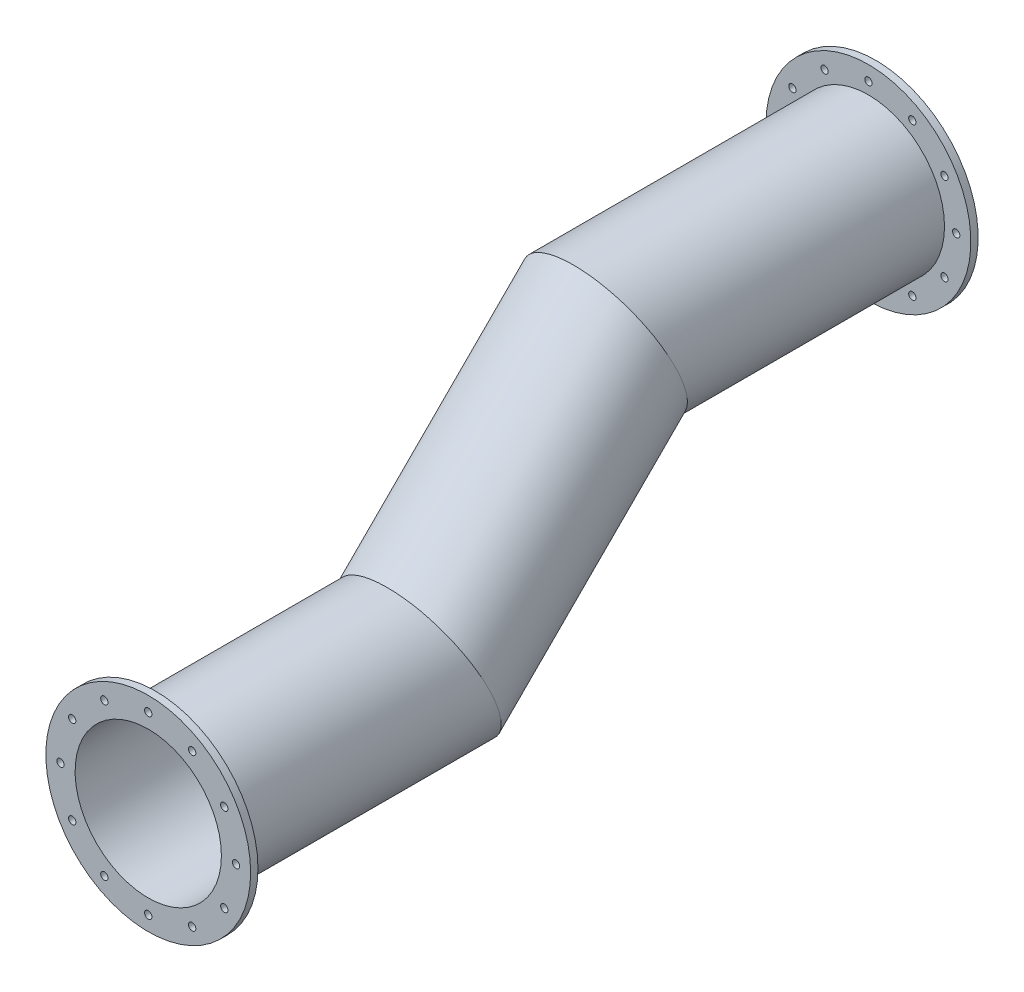
ISO-10303-21;
HEADER;
FILE_DESCRIPTION(('STEP AP214'),'2;1');
FILE_NAME('part.step','',(''),(''),'','','');
FILE_SCHEMA(('AUTOMOTIVE_DESIGN { 1 0 10303 214 1 1 1 1 }'));
ENDSEC;
DATA;
#1=APPLICATION_CONTEXT('core data for automotive mechanical design processes');
#2=APPLICATION_PROTOCOL_DEFINITION('international standard','automotive_design',2000,#1);
#3=PRODUCT_CONTEXT('',#1,'mechanical');
#4=PRODUCT('Part','Part','',(#3));
#5=PRODUCT_RELATED_PRODUCT_CATEGORY('part','',(#4));
#6=PRODUCT_DEFINITION_FORMATION('','',#4);
#7=PRODUCT_DEFINITION_CONTEXT('part definition',#1,'design');
#8=PRODUCT_DEFINITION('design','',#6,#7);
#9=PRODUCT_DEFINITION_SHAPE('','',#8);
#10=(LENGTH_UNIT() NAMED_UNIT(*) SI_UNIT(.MILLI.,.METRE.));
#11=(NAMED_UNIT(*) PLANE_ANGLE_UNIT() SI_UNIT($,.RADIAN.));
#12=(NAMED_UNIT(*) SI_UNIT($,.STERADIAN.) SOLID_ANGLE_UNIT());
#13=UNCERTAINTY_MEASURE_WITH_UNIT(LENGTH_MEASURE(1.E-05),#10,'distance_accuracy_value','');
#14=(GEOMETRIC_REPRESENTATION_CONTEXT(3) GLOBAL_UNCERTAINTY_ASSIGNED_CONTEXT((#13)) GLOBAL_UNIT_ASSIGNED_CONTEXT((#10,
#11,#12)) REPRESENTATION_CONTEXT('',''));
#15=CARTESIAN_POINT('',(0.,0.,0.));
#16=DIRECTION('',(0.,0.,1.));
#17=DIRECTION('',(1.,0.,0.));
#18=AXIS2_PLACEMENT_3D('',#15,#16,#17);
#19=CARTESIAN_POINT('',(0.,127.279220613579,-261.615728752538));
#20=DIRECTION('',(0.,0.,-1.));
#21=DIRECTION('',(-1.,0.,0.));
#22=AXIS2_PLACEMENT_3D('',#19,#20,#21);
#23=CYLINDRICAL_SURFACE('',#22,52.);
#24=CARTESIAN_POINT('',(0.,127.279220613579,-307.279220613579));
#25=DIRECTION('',(0.,0.38268343236509,-0.923879532511287));
#26=DIRECTION('',(0.,0.923879532511287,0.38268343236509));
#27=AXIS2_PLACEMENT_3D('',#24,#25,#26);
#28=ELLIPSE('',#27,56.2843944152045,52.);
#29=CARTESIAN_POINT('',(0.,179.279220613579,-285.740115370178));
#30=VERTEX_POINT('',#29);
#31=EDGE_CURVE('E48',#30,#30,#28,.T.);
#32=ORIENTED_EDGE('',*,*,#31,.T.);
#33=EDGE_LOOP('',(#32));
#34=FACE_BOUND('',#33,.T.);
#35=CARTESIAN_POINT('',(0.,127.279220613579,-487.279220613578));
#36=DIRECTION('',(0.,0.,1.));
#37=DIRECTION('',(1.,0.,0.));
#38=AXIS2_PLACEMENT_3D('',#35,#36,#37);
#39=CIRCLE('',#38,52.);
#40=CARTESIAN_POINT('',(52.,127.279220613579,-487.279220613578));
#41=VERTEX_POINT('',#40);
#42=EDGE_CURVE('E51',#41,#41,#39,.T.);
#43=ORIENTED_EDGE('',*,*,#42,.T.);
#44=EDGE_LOOP('',(#43));
#45=FACE_BOUND('',#44,.T.);
#46=ADVANCED_FACE('F36',(#34,#45),#23,.T.);
#47=CARTESIAN_POINT('',(0.,-32.2889647475984,-147.711035252402));
#48=DIRECTION('',(0.,0.707106781186548,-0.707106781186547));
#49=DIRECTION('',(0.,0.707106781186547,0.707106781186548));
#50=AXIS2_PLACEMENT_3D('',#47,#48,#49);
#51=CYLINDRICAL_SURFACE('',#50,52.);
#52=CARTESIAN_POINT('',(0.,0.,-180.));
#53=DIRECTION('',(0.,0.38268343236509,-0.923879532511287));
#54=DIRECTION('',(0.,-0.923879532511287,-0.38268343236509));
#55=AXIS2_PLACEMENT_3D('',#52,#53,#54);
#56=ELLIPSE('',#55,56.2843944152045,52.);
#57=CARTESIAN_POINT('',(0.,-52.,-201.539105243401));
#58=VERTEX_POINT('',#57);
#59=EDGE_CURVE('E10',#58,#58,#56,.T.);
#60=ORIENTED_EDGE('',*,*,#59,.T.);
#61=EDGE_LOOP('',(#60));
#62=FACE_BOUND('',#61,.T.);
#63=ORIENTED_EDGE('',*,*,#31,.F.);
#64=EDGE_LOOP('',(#63));
#65=FACE_BOUND('',#64,.T.);
#66=ADVANCED_FACE('F262',(#62,#65),#51,.T.);
#67=CARTESIAN_POINT('',(0.,0.,0.));
#68=DIRECTION('',(0.,0.,-1.));
#69=DIRECTION('',(-1.,0.,0.));
#70=AXIS2_PLACEMENT_3D('',#67,#68,#69);
#71=CYLINDRICAL_SURFACE('',#70,52.);
#72=CARTESIAN_POINT('',(0.,0.,0.));
#73=DIRECTION('',(0.,0.,1.));
#74=DIRECTION('',(1.,0.,0.));
#75=AXIS2_PLACEMENT_3D('',#72,#73,#74);
#76=CIRCLE('',#75,52.);
#77=CARTESIAN_POINT('',(52.,0.,0.));
#78=VERTEX_POINT('',#77);
#79=EDGE_CURVE('E40',#78,#78,#76,.T.);
#80=ORIENTED_EDGE('',*,*,#79,.F.);
#81=EDGE_LOOP('',(#80));
#82=FACE_BOUND('',#81,.T.);
#83=ORIENTED_EDGE('',*,*,#59,.F.);
#84=EDGE_LOOP('',(#83));
#85=FACE_BOUND('',#84,.T.);
#86=ADVANCED_FACE('F38',(#82,#85),#71,.T.);
#87=CARTESIAN_POINT('',(0.,127.279220613579,-261.615728752538));
#88=DIRECTION('',(0.,0.,-1.));
#89=DIRECTION('',(-1.,0.,0.));
#90=AXIS2_PLACEMENT_3D('',#87,#88,#89);
#91=CYLINDRICAL_SURFACE('',#90,50.);
#92=CARTESIAN_POINT('',(0.,127.279220613579,-307.279220613579));
#93=DIRECTION('',(0.,0.38268343236509,-0.923879532511287));
#94=DIRECTION('',(0.,0.923879532511287,0.38268343236509));
#95=AXIS2_PLACEMENT_3D('',#92,#93,#94);
#96=ELLIPSE('',#95,54.1196100146197,50.);
#97=CARTESIAN_POINT('',(0.,177.279220613579,-286.568542494924));
#98=VERTEX_POINT('',#97);
#99=EDGE_CURVE('E146',#98,#98,#96,.T.);
#100=ORIENTED_EDGE('',*,*,#99,.F.);
#101=EDGE_LOOP('',(#100));
#102=FACE_BOUND('',#101,.T.);
#103=CARTESIAN_POINT('',(0.,127.279220613579,-492.279220613578));
#104=DIRECTION('',(0.,0.,-1.));
#105=DIRECTION('',(-1.,0.,0.));
#106=AXIS2_PLACEMENT_3D('',#103,#104,#105);
#107=CIRCLE('',#106,50.);
#108=CARTESIAN_POINT('',(-50.,127.279220613579,-492.279220613578));
#109=VERTEX_POINT('',#108);
#110=EDGE_CURVE('E66',#109,#109,#107,.T.);
#111=ORIENTED_EDGE('',*,*,#110,.T.);
#112=EDGE_LOOP('',(#111));
#113=FACE_BOUND('',#112,.T.);
#114=ADVANCED_FACE('F156',(#102,#113),#91,.F.);
#115=CARTESIAN_POINT('',(0.,-32.2889647475984,-147.711035252402));
#116=DIRECTION('',(0.,0.707106781186548,-0.707106781186547));
#117=DIRECTION('',(0.,0.707106781186547,0.707106781186548));
#118=AXIS2_PLACEMENT_3D('',#115,#116,#117);
#119=CYLINDRICAL_SURFACE('',#118,50.);
#120=CARTESIAN_POINT('',(0.,0.,-180.));
#121=DIRECTION('',(0.,0.38268343236509,-0.923879532511287));
#122=DIRECTION('',(0.,-0.923879532511287,-0.38268343236509));
#123=AXIS2_PLACEMENT_3D('',#120,#121,#122);
#124=ELLIPSE('',#123,54.1196100146197,50.);
#125=CARTESIAN_POINT('',(0.,-50.,-200.710678118655));
#126=VERTEX_POINT('',#125);
#127=EDGE_CURVE('E149',#126,#126,#124,.T.);
#128=ORIENTED_EDGE('',*,*,#127,.F.);
#129=EDGE_LOOP('',(#128));
#130=FACE_BOUND('',#129,.T.);
#131=ORIENTED_EDGE('',*,*,#99,.T.);
#132=EDGE_LOOP('',(#131));
#133=FACE_BOUND('',#132,.T.);
#134=ADVANCED_FACE('F154',(#130,#133),#119,.F.);
#135=CARTESIAN_POINT('',(0.,0.,0.));
#136=DIRECTION('',(0.,0.,-1.));
#137=DIRECTION('',(-1.,0.,0.));
#138=AXIS2_PLACEMENT_3D('',#135,#136,#137);
#139=CYLINDRICAL_SURFACE('',#138,50.);
#140=ORIENTED_EDGE('',*,*,#127,.T.);
#141=EDGE_LOOP('',(#140));
#142=FACE_BOUND('',#141,.T.);
#143=CARTESIAN_POINT('',(0.,0.,5.));
#144=DIRECTION('',(0.,0.,1.));
#145=DIRECTION('',(1.,0.,0.));
#146=AXIS2_PLACEMENT_3D('',#143,#144,#145);
#147=CIRCLE('',#146,50.);
#148=CARTESIAN_POINT('',(50.,0.,5.));
#149=VERTEX_POINT('',#148);
#150=EDGE_CURVE('E137',#149,#149,#147,.T.);
#151=ORIENTED_EDGE('',*,*,#150,.T.);
#152=EDGE_LOOP('',(#151));
#153=FACE_BOUND('',#152,.T.);
#154=ADVANCED_FACE('F350',(#142,#153),#139,.F.);
#155=CARTESIAN_POINT('',(0.,0.,5.));
#156=DIRECTION('',(0.,0.,1.));
#157=DIRECTION('',(1.,0.,0.));
#158=AXIS2_PLACEMENT_3D('',#155,#156,#157);
#159=PLANE('',#158);
#160=CARTESIAN_POINT('',(51.9615242270663,-30.,5.));
#161=DIRECTION('',(0.,0.,1.));
#162=DIRECTION('',(1.,0.,0.));
#163=AXIS2_PLACEMENT_3D('',#160,#161,#162);
#164=CIRCLE('',#163,2.5);
#165=CARTESIAN_POINT('',(54.4615242270663,-30.,5.));
#166=VERTEX_POINT('',#165);
#167=EDGE_CURVE('E74',#166,#166,#164,.T.);
#168=ORIENTED_EDGE('',*,*,#167,.F.);
#169=EDGE_LOOP('',(#168));
#170=FACE_BOUND('',#169,.T.);
#171=CARTESIAN_POINT('',(51.9615242270663,30.,5.));
#172=DIRECTION('',(0.,0.,1.));
#173=DIRECTION('',(1.,0.,0.));
#174=AXIS2_PLACEMENT_3D('',#171,#172,#173);
#175=CIRCLE('',#174,2.50000000000001);
#176=CARTESIAN_POINT('',(54.4615242270663,30.,5.));
#177=VERTEX_POINT('',#176);
#178=EDGE_CURVE('E86',#177,#177,#175,.T.);
#179=ORIENTED_EDGE('',*,*,#178,.F.);
#180=EDGE_LOOP('',(#179));
#181=FACE_BOUND('',#180,.T.);
#182=CARTESIAN_POINT('',(0.,60.,5.));
#183=DIRECTION('',(0.,0.,1.));
#184=DIRECTION('',(1.,0.,0.));
#185=AXIS2_PLACEMENT_3D('',#182,#183,#184);
#186=CIRCLE('',#185,2.5);
#187=CARTESIAN_POINT('',(2.5,60.,5.));
#188=VERTEX_POINT('',#187);
#189=EDGE_CURVE('E98',#188,#188,#186,.T.);
#190=ORIENTED_EDGE('',*,*,#189,.F.);
#191=EDGE_LOOP('',(#190));
#192=FACE_BOUND('',#191,.T.);
#193=CARTESIAN_POINT('',(-51.9615242270663,30.,5.));
#194=DIRECTION('',(0.,0.,1.));
#195=DIRECTION('',(1.,0.,0.));
#196=AXIS2_PLACEMENT_3D('',#193,#194,#195);
#197=CIRCLE('',#196,2.5);
#198=CARTESIAN_POINT('',(-49.4615242270663,30.,5.));
#199=VERTEX_POINT('',#198);
#200=EDGE_CURVE('E110',#199,#199,#197,.T.);
#201=ORIENTED_EDGE('',*,*,#200,.F.);
#202=EDGE_LOOP('',(#201));
#203=FACE_BOUND('',#202,.T.);
#204=CARTESIAN_POINT('',(-51.9615242270663,-30.,5.));
#205=DIRECTION('',(0.,0.,1.));
#206=DIRECTION('',(1.,0.,0.));
#207=AXIS2_PLACEMENT_3D('',#204,#205,#206);
#208=CIRCLE('',#207,2.50000000000001);
#209=CARTESIAN_POINT('',(-49.4615242270663,-30.,5.));
#210=VERTEX_POINT('',#209);
#211=EDGE_CURVE('E122',#210,#210,#208,.T.);
#212=ORIENTED_EDGE('',*,*,#211,.F.);
#213=EDGE_LOOP('',(#212));
#214=FACE_BOUND('',#213,.T.);
#215=CARTESIAN_POINT('',(0.,-60.,5.));
#216=DIRECTION('',(0.,0.,1.));
#217=DIRECTION('',(1.,0.,0.));
#218=AXIS2_PLACEMENT_3D('',#215,#216,#217);
#219=CIRCLE('',#218,2.5);
#220=CARTESIAN_POINT('',(2.5,-60.,5.));
#221=VERTEX_POINT('',#220);
#222=EDGE_CURVE('E134',#221,#221,#219,.T.);
#223=ORIENTED_EDGE('',*,*,#222,.F.);
#224=EDGE_LOOP('',(#223));
#225=FACE_BOUND('',#224,.T.);
#226=CARTESIAN_POINT('',(0.,0.,5.));
#227=DIRECTION('',(0.,0.,1.));
#228=DIRECTION('',(1.,0.,0.));
#229=AXIS2_PLACEMENT_3D('',#226,#227,#228);
#230=CIRCLE('',#229,70.0000000000001);
#231=CARTESIAN_POINT('',(70.0000000000001,0.,5.));
#232=VERTEX_POINT('',#231);
#233=EDGE_CURVE('E143',#232,#232,#230,.T.);
#234=ORIENTED_EDGE('',*,*,#233,.T.);
#235=EDGE_LOOP('',(#234));
#236=FACE_BOUND('',#235,.T.);
#237=ORIENTED_EDGE('',*,*,#150,.F.);
#238=EDGE_LOOP('',(#237));
#239=FACE_BOUND('',#238,.T.);
#240=CARTESIAN_POINT('',(-30.,-51.9615242270663,5.));
#241=DIRECTION('',(0.,0.,1.));
#242=DIRECTION('',(1.,0.,0.));
#243=AXIS2_PLACEMENT_3D('',#240,#241,#242);
#244=CIRCLE('',#243,2.5);
#245=CARTESIAN_POINT('',(-27.5,-51.9615242270663,5.));
#246=VERTEX_POINT('',#245);
#247=EDGE_CURVE('E128',#246,#246,#244,.T.);
#248=ORIENTED_EDGE('',*,*,#247,.F.);
#249=EDGE_LOOP('',(#248));
#250=FACE_BOUND('',#249,.T.);
#251=CARTESIAN_POINT('',(-60.,0.,5.));
#252=DIRECTION('',(0.,0.,1.));
#253=DIRECTION('',(1.,0.,0.));
#254=AXIS2_PLACEMENT_3D('',#251,#252,#253);
#255=CIRCLE('',#254,2.5);
#256=CARTESIAN_POINT('',(-57.5,0.,5.));
#257=VERTEX_POINT('',#256);
#258=EDGE_CURVE('E116',#257,#257,#255,.T.);
#259=ORIENTED_EDGE('',*,*,#258,.F.);
#260=EDGE_LOOP('',(#259));
#261=FACE_BOUND('',#260,.T.);
#262=CARTESIAN_POINT('',(-30.,51.9615242270663,5.));
#263=DIRECTION('',(0.,0.,1.));
#264=DIRECTION('',(1.,0.,0.));
#265=AXIS2_PLACEMENT_3D('',#262,#263,#264);
#266=CIRCLE('',#265,2.5);
#267=CARTESIAN_POINT('',(-27.5,51.9615242270663,5.));
#268=VERTEX_POINT('',#267);
#269=EDGE_CURVE('E104',#268,#268,#266,.T.);
#270=ORIENTED_EDGE('',*,*,#269,.F.);
#271=EDGE_LOOP('',(#270));
#272=FACE_BOUND('',#271,.T.);
#273=CARTESIAN_POINT('',(30.,51.9615242270663,5.));
#274=DIRECTION('',(0.,0.,1.));
#275=DIRECTION('',(1.,0.,0.));
#276=AXIS2_PLACEMENT_3D('',#273,#274,#275);
#277=CIRCLE('',#276,2.50000000000001);
#278=CARTESIAN_POINT('',(32.5,51.9615242270663,5.));
#279=VERTEX_POINT('',#278);
#280=EDGE_CURVE('E92',#279,#279,#277,.T.);
#281=ORIENTED_EDGE('',*,*,#280,.F.);
#282=EDGE_LOOP('',(#281));
#283=FACE_BOUND('',#282,.T.);
#284=CARTESIAN_POINT('',(60.,0.,5.));
#285=DIRECTION('',(0.,0.,1.));
#286=DIRECTION('',(1.,0.,0.));
#287=AXIS2_PLACEMENT_3D('',#284,#285,#286);
#288=CIRCLE('',#287,2.5);
#289=CARTESIAN_POINT('',(62.5,0.,5.));
#290=VERTEX_POINT('',#289);
#291=EDGE_CURVE('E80',#290,#290,#288,.T.);
#292=ORIENTED_EDGE('',*,*,#291,.F.);
#293=EDGE_LOOP('',(#292));
#294=FACE_BOUND('',#293,.T.);
#295=CARTESIAN_POINT('',(30.,-51.9615242270663,5.));
#296=DIRECTION('',(0.,0.,1.));
#297=DIRECTION('',(1.,0.,0.));
#298=AXIS2_PLACEMENT_3D('',#295,#296,#297);
#299=CIRCLE('',#298,2.5);
#300=CARTESIAN_POINT('',(32.5,-51.9615242270663,5.));
#301=VERTEX_POINT('',#300);
#302=EDGE_CURVE('E58',#301,#301,#299,.T.);
#303=ORIENTED_EDGE('',*,*,#302,.F.);
#304=EDGE_LOOP('',(#303));
#305=FACE_BOUND('',#304,.T.);
#306=ADVANCED_FACE('F160',(#170,#181,#192,#203,#214,#225,#236,#239,#250,#261,#272,#283,#294,
#305),#159,.T.);
#307=CARTESIAN_POINT('',(0.,0.,0.));
#308=DIRECTION('',(0.,0.,1.));
#309=DIRECTION('',(1.,0.,0.));
#310=AXIS2_PLACEMENT_3D('',#307,#308,#309);
#311=PLANE('',#310);
#312=ORIENTED_EDGE('',*,*,#79,.T.);
#313=EDGE_LOOP('',(#312));
#314=FACE_BOUND('',#313,.T.);
#315=CARTESIAN_POINT('',(0.,0.,0.));
#316=DIRECTION('',(0.,0.,1.));
#317=DIRECTION('',(1.,0.,0.));
#318=AXIS2_PLACEMENT_3D('',#315,#316,#317);
#319=CIRCLE('',#318,70.0000000000001);
#320=CARTESIAN_POINT('',(70.0000000000001,0.,0.));
#321=VERTEX_POINT('',#320);
#322=EDGE_CURVE('E142',#321,#321,#319,.T.);
#323=ORIENTED_EDGE('',*,*,#322,.F.);
#324=EDGE_LOOP('',(#323));
#325=FACE_BOUND('',#324,.T.);
#326=CARTESIAN_POINT('',(0.,-60.,0.));
#327=DIRECTION('',(0.,0.,1.));
#328=DIRECTION('',(1.,0.,0.));
#329=AXIS2_PLACEMENT_3D('',#326,#327,#328);
#330=CIRCLE('',#329,2.5);
#331=CARTESIAN_POINT('',(2.5,-60.,0.));
#332=VERTEX_POINT('',#331);
#333=EDGE_CURVE('E131',#332,#332,#330,.T.);
#334=ORIENTED_EDGE('',*,*,#333,.T.);
#335=EDGE_LOOP('',(#334));
#336=FACE_BOUND('',#335,.T.);
#337=CARTESIAN_POINT('',(-30.,-51.9615242270663,0.));
#338=DIRECTION('',(0.,0.,1.));
#339=DIRECTION('',(1.,0.,0.));
#340=AXIS2_PLACEMENT_3D('',#337,#338,#339);
#341=CIRCLE('',#340,2.5);
#342=CARTESIAN_POINT('',(-27.5,-51.9615242270663,0.));
#343=VERTEX_POINT('',#342);
#344=EDGE_CURVE('E125',#343,#343,#341,.T.);
#345=ORIENTED_EDGE('',*,*,#344,.T.);
#346=EDGE_LOOP('',(#345));
#347=FACE_BOUND('',#346,.T.);
#348=CARTESIAN_POINT('',(-51.9615242270663,-30.,0.));
#349=DIRECTION('',(0.,0.,1.));
#350=DIRECTION('',(1.,0.,0.));
#351=AXIS2_PLACEMENT_3D('',#348,#349,#350);
#352=CIRCLE('',#351,2.50000000000001);
#353=CARTESIAN_POINT('',(-49.4615242270663,-30.,0.));
#354=VERTEX_POINT('',#353);
#355=EDGE_CURVE('E119',#354,#354,#352,.T.);
#356=ORIENTED_EDGE('',*,*,#355,.T.);
#357=EDGE_LOOP('',(#356));
#358=FACE_BOUND('',#357,.T.);
#359=CARTESIAN_POINT('',(-60.,0.,0.));
#360=DIRECTION('',(0.,0.,1.));
#361=DIRECTION('',(1.,0.,0.));
#362=AXIS2_PLACEMENT_3D('',#359,#360,#361);
#363=CIRCLE('',#362,2.5);
#364=CARTESIAN_POINT('',(-57.5,0.,0.));
#365=VERTEX_POINT('',#364);
#366=EDGE_CURVE('E113',#365,#365,#363,.T.);
#367=ORIENTED_EDGE('',*,*,#366,.T.);
#368=EDGE_LOOP('',(#367));
#369=FACE_BOUND('',#368,.T.);
#370=CARTESIAN_POINT('',(-51.9615242270663,30.,0.));
#371=DIRECTION('',(0.,0.,1.));
#372=DIRECTION('',(1.,0.,0.));
#373=AXIS2_PLACEMENT_3D('',#370,#371,#372);
#374=CIRCLE('',#373,2.5);
#375=CARTESIAN_POINT('',(-49.4615242270663,30.,0.));
#376=VERTEX_POINT('',#375);
#377=EDGE_CURVE('E107',#376,#376,#374,.T.);
#378=ORIENTED_EDGE('',*,*,#377,.T.);
#379=EDGE_LOOP('',(#378));
#380=FACE_BOUND('',#379,.T.);
#381=CARTESIAN_POINT('',(-30.,51.9615242270663,0.));
#382=DIRECTION('',(0.,0.,1.));
#383=DIRECTION('',(1.,0.,0.));
#384=AXIS2_PLACEMENT_3D('',#381,#382,#383);
#385=CIRCLE('',#384,2.5);
#386=CARTESIAN_POINT('',(-27.5,51.9615242270663,0.));
#387=VERTEX_POINT('',#386);
#388=EDGE_CURVE('E101',#387,#387,#385,.T.);
#389=ORIENTED_EDGE('',*,*,#388,.T.);
#390=EDGE_LOOP('',(#389));
#391=FACE_BOUND('',#390,.T.);
#392=CARTESIAN_POINT('',(0.,60.,0.));
#393=DIRECTION('',(0.,0.,1.));
#394=DIRECTION('',(1.,0.,0.));
#395=AXIS2_PLACEMENT_3D('',#392,#393,#394);
#396=CIRCLE('',#395,2.5);
#397=CARTESIAN_POINT('',(2.5,60.,0.));
#398=VERTEX_POINT('',#397);
#399=EDGE_CURVE('E95',#398,#398,#396,.T.);
#400=ORIENTED_EDGE('',*,*,#399,.T.);
#401=EDGE_LOOP('',(#400));
#402=FACE_BOUND('',#401,.T.);
#403=CARTESIAN_POINT('',(30.,51.9615242270663,0.));
#404=DIRECTION('',(0.,0.,1.));
#405=DIRECTION('',(1.,0.,0.));
#406=AXIS2_PLACEMENT_3D('',#403,#404,#405);
#407=CIRCLE('',#406,2.50000000000001);
#408=CARTESIAN_POINT('',(32.5,51.9615242270663,0.));
#409=VERTEX_POINT('',#408);
#410=EDGE_CURVE('E89',#409,#409,#407,.T.);
#411=ORIENTED_EDGE('',*,*,#410,.T.);
#412=EDGE_LOOP('',(#411));
#413=FACE_BOUND('',#412,.T.);
#414=CARTESIAN_POINT('',(51.9615242270663,30.,0.));
#415=DIRECTION('',(0.,0.,1.));
#416=DIRECTION('',(1.,0.,0.));
#417=AXIS2_PLACEMENT_3D('',#414,#415,#416);
#418=CIRCLE('',#417,2.50000000000001);
#419=CARTESIAN_POINT('',(54.4615242270663,30.,0.));
#420=VERTEX_POINT('',#419);
#421=EDGE_CURVE('E83',#420,#420,#418,.T.);
#422=ORIENTED_EDGE('',*,*,#421,.T.);
#423=EDGE_LOOP('',(#422));
#424=FACE_BOUND('',#423,.T.);
#425=CARTESIAN_POINT('',(60.,0.,0.));
#426=DIRECTION('',(0.,0.,1.));
#427=DIRECTION('',(1.,0.,0.));
#428=AXIS2_PLACEMENT_3D('',#425,#426,#427);
#429=CIRCLE('',#428,2.5);
#430=CARTESIAN_POINT('',(62.5,0.,0.));
#431=VERTEX_POINT('',#430);
#432=EDGE_CURVE('E77',#431,#431,#429,.T.);
#433=ORIENTED_EDGE('',*,*,#432,.T.);
#434=EDGE_LOOP('',(#433));
#435=FACE_BOUND('',#434,.T.);
#436=CARTESIAN_POINT('',(51.9615242270663,-30.,0.));
#437=DIRECTION('',(0.,0.,1.));
#438=DIRECTION('',(1.,0.,0.));
#439=AXIS2_PLACEMENT_3D('',#436,#437,#438);
#440=CIRCLE('',#439,2.5);
#441=CARTESIAN_POINT('',(54.4615242270663,-30.,0.));
#442=VERTEX_POINT('',#441);
#443=EDGE_CURVE('E72',#442,#442,#440,.T.);
#444=ORIENTED_EDGE('',*,*,#443,.T.);
#445=EDGE_LOOP('',(#444));
#446=FACE_BOUND('',#445,.T.);
#447=CARTESIAN_POINT('',(30.,-51.9615242270663,0.));
#448=DIRECTION('',(0.,0.,1.));
#449=DIRECTION('',(1.,0.,0.));
#450=AXIS2_PLACEMENT_3D('',#447,#448,#449);
#451=CIRCLE('',#450,2.5);
#452=CARTESIAN_POINT('',(32.5,-51.9615242270663,0.));
#453=VERTEX_POINT('',#452);
#454=EDGE_CURVE('E53',#453,#453,#451,.T.);
#455=ORIENTED_EDGE('',*,*,#454,.T.);
#456=EDGE_LOOP('',(#455));
#457=FACE_BOUND('',#456,.T.);
#458=ADVANCED_FACE('F270',(#314,#325,#336,#347,#358,#369,#380,#391,#402,#413,#424,#435,#446,
#457),#311,.F.);
#459=CARTESIAN_POINT('',(0.,0.,5.));
#460=DIRECTION('',(0.,0.,-1.));
#461=DIRECTION('',(-1.,0.,0.));
#462=AXIS2_PLACEMENT_3D('',#459,#460,#461);
#463=CYLINDRICAL_SURFACE('',#462,70.0000000000001);
#464=ORIENTED_EDGE('',*,*,#233,.F.);
#465=EDGE_LOOP('',(#464));
#466=FACE_BOUND('',#465,.T.);
#467=ORIENTED_EDGE('',*,*,#322,.T.);
#468=EDGE_LOOP('',(#467));
#469=FACE_BOUND('',#468,.T.);
#470=ADVANCED_FACE('F273',(#466,#469),#463,.T.);
#471=CARTESIAN_POINT('',(0.,-60.,5.));
#472=DIRECTION('',(0.,0.,-1.));
#473=DIRECTION('',(-1.,0.,0.));
#474=AXIS2_PLACEMENT_3D('',#471,#472,#473);
#475=CYLINDRICAL_SURFACE('',#474,2.5);
#476=ORIENTED_EDGE('',*,*,#222,.T.);
#477=EDGE_LOOP('',(#476));
#478=FACE_BOUND('',#477,.T.);
#479=ORIENTED_EDGE('',*,*,#333,.F.);
#480=EDGE_LOOP('',(#479));
#481=FACE_BOUND('',#480,.T.);
#482=ADVANCED_FACE('F344',(#478,#481),#475,.F.);
#483=CARTESIAN_POINT('',(-30.,-51.9615242270663,5.));
#484=DIRECTION('',(0.,0.,-1.));
#485=DIRECTION('',(-1.,0.,0.));
#486=AXIS2_PLACEMENT_3D('',#483,#484,#485);
#487=CYLINDRICAL_SURFACE('',#486,2.5);
#488=ORIENTED_EDGE('',*,*,#247,.T.);
#489=EDGE_LOOP('',(#488));
#490=FACE_BOUND('',#489,.T.);
#491=ORIENTED_EDGE('',*,*,#344,.F.);
#492=EDGE_LOOP('',(#491));
#493=FACE_BOUND('',#492,.T.);
#494=ADVANCED_FACE('F340',(#490,#493),#487,.F.);
#495=CARTESIAN_POINT('',(-51.9615242270663,-30.,5.));
#496=DIRECTION('',(0.,0.,-1.));
#497=DIRECTION('',(-1.,0.,0.));
#498=AXIS2_PLACEMENT_3D('',#495,#496,#497);
#499=CYLINDRICAL_SURFACE('',#498,2.50000000000001);
#500=ORIENTED_EDGE('',*,*,#211,.T.);
#501=EDGE_LOOP('',(#500));
#502=FACE_BOUND('',#501,.T.);
#503=ORIENTED_EDGE('',*,*,#355,.F.);
#504=EDGE_LOOP('',(#503));
#505=FACE_BOUND('',#504,.T.);
#506=ADVANCED_FACE('F336',(#502,#505),#499,.F.);
#507=CARTESIAN_POINT('',(-60.,0.,5.));
#508=DIRECTION('',(0.,0.,-1.));
#509=DIRECTION('',(-1.,0.,0.));
#510=AXIS2_PLACEMENT_3D('',#507,#508,#509);
#511=CYLINDRICAL_SURFACE('',#510,2.5);
#512=ORIENTED_EDGE('',*,*,#258,.T.);
#513=EDGE_LOOP('',(#512));
#514=FACE_BOUND('',#513,.T.);
#515=ORIENTED_EDGE('',*,*,#366,.F.);
#516=EDGE_LOOP('',(#515));
#517=FACE_BOUND('',#516,.T.);
#518=ADVANCED_FACE('F332',(#514,#517),#511,.F.);
#519=CARTESIAN_POINT('',(-51.9615242270663,30.,5.));
#520=DIRECTION('',(0.,0.,-1.));
#521=DIRECTION('',(-1.,0.,0.));
#522=AXIS2_PLACEMENT_3D('',#519,#520,#521);
#523=CYLINDRICAL_SURFACE('',#522,2.5);
#524=ORIENTED_EDGE('',*,*,#200,.T.);
#525=EDGE_LOOP('',(#524));
#526=FACE_BOUND('',#525,.T.);
#527=ORIENTED_EDGE('',*,*,#377,.F.);
#528=EDGE_LOOP('',(#527));
#529=FACE_BOUND('',#528,.T.);
#530=ADVANCED_FACE('F328',(#526,#529),#523,.F.);
#531=CARTESIAN_POINT('',(-30.,51.9615242270663,5.));
#532=DIRECTION('',(0.,0.,-1.));
#533=DIRECTION('',(-1.,0.,0.));
#534=AXIS2_PLACEMENT_3D('',#531,#532,#533);
#535=CYLINDRICAL_SURFACE('',#534,2.5);
#536=ORIENTED_EDGE('',*,*,#269,.T.);
#537=EDGE_LOOP('',(#536));
#538=FACE_BOUND('',#537,.T.);
#539=ORIENTED_EDGE('',*,*,#388,.F.);
#540=EDGE_LOOP('',(#539));
#541=FACE_BOUND('',#540,.T.);
#542=ADVANCED_FACE('F324',(#538,#541),#535,.F.);
#543=CARTESIAN_POINT('',(0.,60.,5.));
#544=DIRECTION('',(0.,0.,-1.));
#545=DIRECTION('',(-1.,0.,0.));
#546=AXIS2_PLACEMENT_3D('',#543,#544,#545);
#547=CYLINDRICAL_SURFACE('',#546,2.5);
#548=ORIENTED_EDGE('',*,*,#189,.T.);
#549=EDGE_LOOP('',(#548));
#550=FACE_BOUND('',#549,.T.);
#551=ORIENTED_EDGE('',*,*,#399,.F.);
#552=EDGE_LOOP('',(#551));
#553=FACE_BOUND('',#552,.T.);
#554=ADVANCED_FACE('F320',(#550,#553),#547,.F.);
#555=CARTESIAN_POINT('',(30.,51.9615242270663,5.));
#556=DIRECTION('',(0.,0.,-1.));
#557=DIRECTION('',(-1.,0.,0.));
#558=AXIS2_PLACEMENT_3D('',#555,#556,#557);
#559=CYLINDRICAL_SURFACE('',#558,2.50000000000001);
#560=ORIENTED_EDGE('',*,*,#280,.T.);
#561=EDGE_LOOP('',(#560));
#562=FACE_BOUND('',#561,.T.);
#563=ORIENTED_EDGE('',*,*,#410,.F.);
#564=EDGE_LOOP('',(#563));
#565=FACE_BOUND('',#564,.T.);
#566=ADVANCED_FACE('F316',(#562,#565),#559,.F.);
#567=CARTESIAN_POINT('',(51.9615242270663,30.,5.));
#568=DIRECTION('',(0.,0.,-1.));
#569=DIRECTION('',(-1.,0.,0.));
#570=AXIS2_PLACEMENT_3D('',#567,#568,#569);
#571=CYLINDRICAL_SURFACE('',#570,2.50000000000001);
#572=ORIENTED_EDGE('',*,*,#178,.T.);
#573=EDGE_LOOP('',(#572));
#574=FACE_BOUND('',#573,.T.);
#575=ORIENTED_EDGE('',*,*,#421,.F.);
#576=EDGE_LOOP('',(#575));
#577=FACE_BOUND('',#576,.T.);
#578=ADVANCED_FACE('F309',(#574,#577),#571,.F.);
#579=CARTESIAN_POINT('',(60.,0.,5.));
#580=DIRECTION('',(0.,0.,-1.));
#581=DIRECTION('',(-1.,0.,0.));
#582=AXIS2_PLACEMENT_3D('',#579,#580,#581);
#583=CYLINDRICAL_SURFACE('',#582,2.5);
#584=ORIENTED_EDGE('',*,*,#291,.T.);
#585=EDGE_LOOP('',(#584));
#586=FACE_BOUND('',#585,.T.);
#587=ORIENTED_EDGE('',*,*,#432,.F.);
#588=EDGE_LOOP('',(#587));
#589=FACE_BOUND('',#588,.T.);
#590=ADVANCED_FACE('F303',(#586,#589),#583,.F.);
#591=CARTESIAN_POINT('',(51.9615242270663,-30.,5.));
#592=DIRECTION('',(0.,0.,-1.));
#593=DIRECTION('',(-1.,0.,0.));
#594=AXIS2_PLACEMENT_3D('',#591,#592,#593);
#595=CYLINDRICAL_SURFACE('',#594,2.5);
#596=ORIENTED_EDGE('',*,*,#167,.T.);
#597=EDGE_LOOP('',(#596));
#598=FACE_BOUND('',#597,.T.);
#599=ORIENTED_EDGE('',*,*,#443,.F.);
#600=EDGE_LOOP('',(#599));
#601=FACE_BOUND('',#600,.T.);
#602=ADVANCED_FACE('F255',(#598,#601),#595,.F.);
#603=CARTESIAN_POINT('',(30.,-51.9615242270663,5.));
#604=DIRECTION('',(0.,0.,-1.));
#605=DIRECTION('',(-1.,0.,0.));
#606=AXIS2_PLACEMENT_3D('',#603,#604,#605);
#607=CYLINDRICAL_SURFACE('',#606,2.5);
#608=ORIENTED_EDGE('',*,*,#302,.T.);
#609=EDGE_LOOP('',(#608));
#610=FACE_BOUND('',#609,.T.);
#611=ORIENTED_EDGE('',*,*,#454,.F.);
#612=EDGE_LOOP('',(#611));
#613=FACE_BOUND('',#612,.T.);
#614=ADVANCED_FACE('F245',(#610,#613),#607,.F.);
#615=CARTESIAN_POINT('',(0.,127.279220613579,-492.279220613578));
#616=DIRECTION('',(0.,0.,-1.));
#617=DIRECTION('',(-1.,0.,0.));
#618=AXIS2_PLACEMENT_3D('',#615,#616,#617);
#619=PLANE('',#618);
#620=CARTESIAN_POINT('',(-51.961524227066,97.279220613578,-492.279220613578));
#621=DIRECTION('',(0.,0.,-1.));
#622=DIRECTION('',(-1.,0.,0.));
#623=AXIS2_PLACEMENT_3D('',#620,#621,#622);
#624=CIRCLE('',#623,2.49999999999999);
#625=CARTESIAN_POINT('',(-54.461524227066,97.279220613578,-492.279220613578));
#626=VERTEX_POINT('',#625);
#627=EDGE_CURVE('E224',#626,#626,#624,.T.);
#628=ORIENTED_EDGE('',*,*,#627,.F.);
#629=EDGE_LOOP('',(#628));
#630=FACE_BOUND('',#629,.T.);
#631=CARTESIAN_POINT('',(-51.9615242270666,157.279220613578,-492.279220613578));
#632=DIRECTION('',(0.,0.,-1.));
#633=DIRECTION('',(-1.,0.,0.));
#634=AXIS2_PLACEMENT_3D('',#631,#632,#633);
#635=CIRCLE('',#634,2.50000000000001);
#636=CARTESIAN_POINT('',(-54.4615242270666,157.279220613578,-492.279220613578));
#637=VERTEX_POINT('',#636);
#638=EDGE_CURVE('E212',#637,#637,#635,.T.);
#639=ORIENTED_EDGE('',*,*,#638,.F.);
#640=EDGE_LOOP('',(#639));
#641=FACE_BOUND('',#640,.T.);
#642=CARTESIAN_POINT('',(-4.2632564145606E-13,187.279220613579,-492.279220613578));
#643=DIRECTION('',(0.,0.,-1.));
#644=DIRECTION('',(-1.,0.,0.));
#645=AXIS2_PLACEMENT_3D('',#642,#643,#644);
#646=CIRCLE('',#645,2.50000000000001);
#647=CARTESIAN_POINT('',(-2.50000000000043,187.279220613579,-492.279220613578));
#648=VERTEX_POINT('',#647);
#649=EDGE_CURVE('E200',#648,#648,#646,.T.);
#650=ORIENTED_EDGE('',*,*,#649,.F.);
#651=EDGE_LOOP('',(#650));
#652=FACE_BOUND('',#651,.T.);
#653=CARTESIAN_POINT('',(51.9615242270662,157.279220613579,-492.279220613578));
#654=DIRECTION('',(0.,0.,-1.));
#655=DIRECTION('',(-1.,0.,0.));
#656=AXIS2_PLACEMENT_3D('',#653,#654,#655);
#657=CIRCLE('',#656,2.5);
#658=CARTESIAN_POINT('',(49.4615242270662,157.279220613579,-492.279220613578));
#659=VERTEX_POINT('',#658);
#660=EDGE_CURVE('E188',#659,#659,#657,.T.);
#661=ORIENTED_EDGE('',*,*,#660,.F.);
#662=EDGE_LOOP('',(#661));
#663=FACE_BOUND('',#662,.T.);
#664=CARTESIAN_POINT('',(51.9615242270664,97.2792206135787,-492.279220613578));
#665=DIRECTION('',(0.,0.,-1.));
#666=DIRECTION('',(-1.,0.,0.));
#667=AXIS2_PLACEMENT_3D('',#664,#665,#666);
#668=CIRCLE('',#667,2.5);
#669=CARTESIAN_POINT('',(49.4615242270664,97.2792206135787,-492.279220613578));
#670=VERTEX_POINT('',#669);
#671=EDGE_CURVE('E176',#670,#670,#668,.T.);
#672=ORIENTED_EDGE('',*,*,#671,.F.);
#673=EDGE_LOOP('',(#672));
#674=FACE_BOUND('',#673,.T.);
#675=CARTESIAN_POINT('',(0.,67.2792206135786,-492.279220613578));
#676=DIRECTION('',(0.,0.,-1.));
#677=DIRECTION('',(-1.,0.,0.));
#678=AXIS2_PLACEMENT_3D('',#675,#676,#677);
#679=CIRCLE('',#678,2.5);
#680=CARTESIAN_POINT('',(-2.5,67.2792206135786,-492.279220613578));
#681=VERTEX_POINT('',#680);
#682=EDGE_CURVE('E164',#681,#681,#679,.T.);
#683=ORIENTED_EDGE('',*,*,#682,.F.);
#684=EDGE_LOOP('',(#683));
#685=FACE_BOUND('',#684,.T.);
#686=CARTESIAN_POINT('',(0.,127.279220613579,-492.279220613578));
#687=DIRECTION('',(0.,0.,-1.));
#688=DIRECTION('',(-1.,0.,0.));
#689=AXIS2_PLACEMENT_3D('',#686,#687,#688);
#690=CIRCLE('',#689,70.);
#691=CARTESIAN_POINT('',(-70.,127.279220613579,-492.279220613578));
#692=VERTEX_POINT('',#691);
#693=EDGE_CURVE('E54',#692,#692,#690,.T.);
#694=ORIENTED_EDGE('',*,*,#693,.T.);
#695=EDGE_LOOP('',(#694));
#696=FACE_BOUND('',#695,.T.);
#697=ORIENTED_EDGE('',*,*,#110,.F.);
#698=EDGE_LOOP('',(#697));
#699=FACE_BOUND('',#698,.T.);
#700=CARTESIAN_POINT('',(30.0000000000001,75.3176963865123,-492.279220613578));
#701=DIRECTION('',(0.,0.,-1.));
#702=DIRECTION('',(-1.,0.,0.));
#703=AXIS2_PLACEMENT_3D('',#700,#701,#702);
#704=CIRCLE('',#703,2.5);
#705=CARTESIAN_POINT('',(27.5000000000001,75.3176963865123,-492.279220613578));
#706=VERTEX_POINT('',#705);
#707=EDGE_CURVE('E171',#706,#706,#704,.T.);
#708=ORIENTED_EDGE('',*,*,#707,.F.);
#709=EDGE_LOOP('',(#708));
#710=FACE_BOUND('',#709,.T.);
#711=CARTESIAN_POINT('',(60.,127.279220613579,-492.279220613578));
#712=DIRECTION('',(0.,0.,-1.));
#713=DIRECTION('',(-1.,0.,0.));
#714=AXIS2_PLACEMENT_3D('',#711,#712,#713);
#715=CIRCLE('',#714,2.50000000000002);
#716=CARTESIAN_POINT('',(57.5,127.279220613579,-492.279220613578));
#717=VERTEX_POINT('',#716);
#718=EDGE_CURVE('E182',#717,#717,#715,.T.);
#719=ORIENTED_EDGE('',*,*,#718,.F.);
#720=EDGE_LOOP('',(#719));
#721=FACE_BOUND('',#720,.T.);
#722=CARTESIAN_POINT('',(29.9999999999997,179.240744840645,-492.279220613578));
#723=DIRECTION('',(0.,0.,-1.));
#724=DIRECTION('',(-1.,0.,0.));
#725=AXIS2_PLACEMENT_3D('',#722,#723,#724);
#726=CIRCLE('',#725,2.50000000000002);
#727=CARTESIAN_POINT('',(27.4999999999997,179.240744840645,-492.279220613578));
#728=VERTEX_POINT('',#727);
#729=EDGE_CURVE('E194',#728,#728,#726,.T.);
#730=ORIENTED_EDGE('',*,*,#729,.F.);
#731=EDGE_LOOP('',(#730));
#732=FACE_BOUND('',#731,.T.);
#733=CARTESIAN_POINT('',(-30.0000000000004,179.240744840645,-492.279220613578));
#734=DIRECTION('',(0.,0.,-1.));
#735=DIRECTION('',(-1.,0.,0.));
#736=AXIS2_PLACEMENT_3D('',#733,#734,#735);
#737=CIRCLE('',#736,2.5);
#738=CARTESIAN_POINT('',(-32.5000000000004,179.240744840645,-492.279220613578));
#739=VERTEX_POINT('',#738);
#740=EDGE_CURVE('E206',#739,#739,#737,.T.);
#741=ORIENTED_EDGE('',*,*,#740,.F.);
#742=EDGE_LOOP('',(#741));
#743=FACE_BOUND('',#742,.T.);
#744=CARTESIAN_POINT('',(-60.,127.279220613578,-492.279220613578));
#745=DIRECTION('',(0.,0.,-1.));
#746=DIRECTION('',(-1.,0.,0.));
#747=AXIS2_PLACEMENT_3D('',#744,#745,#746);
#748=CIRCLE('',#747,2.50000000000001);
#749=CARTESIAN_POINT('',(-62.5,127.279220613578,-492.279220613578));
#750=VERTEX_POINT('',#749);
#751=EDGE_CURVE('E218',#750,#750,#748,.T.);
#752=ORIENTED_EDGE('',*,*,#751,.F.);
#753=EDGE_LOOP('',(#752));
#754=FACE_BOUND('',#753,.T.);
#755=CARTESIAN_POINT('',(-29.9999999999993,75.3176963865119,-492.279220613578));
#756=DIRECTION('',(0.,0.,-1.));
#757=DIRECTION('',(-1.,0.,0.));
#758=AXIS2_PLACEMENT_3D('',#755,#756,#757);
#759=CIRCLE('',#758,2.5);
#760=CARTESIAN_POINT('',(-32.4999999999993,75.3176963865119,-492.279220613578));
#761=VERTEX_POINT('',#760);
#762=EDGE_CURVE('E230',#761,#761,#759,.T.);
#763=ORIENTED_EDGE('',*,*,#762,.F.);
#764=EDGE_LOOP('',(#763));
#765=FACE_BOUND('',#764,.T.);
#766=ADVANCED_FACE('F242',(#630,#641,#652,#663,#674,#685,#696,#699,#710,#721,#732,#743,#754,
#765),#619,.T.);
#767=CARTESIAN_POINT('',(0.,127.279220613579,-487.279220613578));
#768=DIRECTION('',(0.,0.,-1.));
#769=DIRECTION('',(-1.,0.,0.));
#770=AXIS2_PLACEMENT_3D('',#767,#768,#769);
#771=PLANE('',#770);
#772=ORIENTED_EDGE('',*,*,#42,.F.);
#773=EDGE_LOOP('',(#772));
#774=FACE_BOUND('',#773,.T.);
#775=CARTESIAN_POINT('',(0.,127.279220613579,-487.279220613578));
#776=DIRECTION('',(0.,0.,-1.));
#777=DIRECTION('',(-1.,0.,0.));
#778=AXIS2_PLACEMENT_3D('',#775,#776,#777);
#779=CIRCLE('',#778,70.);
#780=CARTESIAN_POINT('',(-70.,127.279220613579,-487.279220613578));
#781=VERTEX_POINT('',#780);
#782=EDGE_CURVE('E61',#781,#781,#779,.T.);
#783=ORIENTED_EDGE('',*,*,#782,.F.);
#784=EDGE_LOOP('',(#783));
#785=FACE_BOUND('',#784,.T.);
#786=CARTESIAN_POINT('',(0.,67.2792206135786,-487.279220613578));
#787=DIRECTION('',(0.,0.,-1.));
#788=DIRECTION('',(-1.,0.,0.));
#789=AXIS2_PLACEMENT_3D('',#786,#787,#788);
#790=CIRCLE('',#789,2.5);
#791=CARTESIAN_POINT('',(-2.5,67.2792206135786,-487.279220613578));
#792=VERTEX_POINT('',#791);
#793=EDGE_CURVE('E166',#792,#792,#790,.T.);
#794=ORIENTED_EDGE('',*,*,#793,.T.);
#795=EDGE_LOOP('',(#794));
#796=FACE_BOUND('',#795,.T.);
#797=CARTESIAN_POINT('',(30.0000000000001,75.3176963865123,-487.279220613578));
#798=DIRECTION('',(0.,0.,-1.));
#799=DIRECTION('',(-1.,0.,0.));
#800=AXIS2_PLACEMENT_3D('',#797,#798,#799);
#801=CIRCLE('',#800,2.5);
#802=CARTESIAN_POINT('',(27.5000000000001,75.3176963865123,-487.279220613578));
#803=VERTEX_POINT('',#802);
#804=EDGE_CURVE('E173',#803,#803,#801,.T.);
#805=ORIENTED_EDGE('',*,*,#804,.T.);
#806=EDGE_LOOP('',(#805));
#807=FACE_BOUND('',#806,.T.);
#808=CARTESIAN_POINT('',(51.9615242270664,97.2792206135787,-487.279220613578));
#809=DIRECTION('',(0.,0.,-1.));
#810=DIRECTION('',(-1.,0.,0.));
#811=AXIS2_PLACEMENT_3D('',#808,#809,#810);
#812=CIRCLE('',#811,2.5);
#813=CARTESIAN_POINT('',(49.4615242270664,97.2792206135787,-487.279220613578));
#814=VERTEX_POINT('',#813);
#815=EDGE_CURVE('E179',#814,#814,#812,.T.);
#816=ORIENTED_EDGE('',*,*,#815,.T.);
#817=EDGE_LOOP('',(#816));
#818=FACE_BOUND('',#817,.T.);
#819=CARTESIAN_POINT('',(60.,127.279220613579,-487.279220613578));
#820=DIRECTION('',(0.,0.,-1.));
#821=DIRECTION('',(-1.,0.,0.));
#822=AXIS2_PLACEMENT_3D('',#819,#820,#821);
#823=CIRCLE('',#822,2.50000000000002);
#824=CARTESIAN_POINT('',(57.5,127.279220613579,-487.279220613578));
#825=VERTEX_POINT('',#824);
#826=EDGE_CURVE('E185',#825,#825,#823,.T.);
#827=ORIENTED_EDGE('',*,*,#826,.T.);
#828=EDGE_LOOP('',(#827));
#829=FACE_BOUND('',#828,.T.);
#830=CARTESIAN_POINT('',(51.9615242270662,157.279220613579,-487.279220613578));
#831=DIRECTION('',(0.,0.,-1.));
#832=DIRECTION('',(-1.,0.,0.));
#833=AXIS2_PLACEMENT_3D('',#830,#831,#832);
#834=CIRCLE('',#833,2.5);
#835=CARTESIAN_POINT('',(49.4615242270662,157.279220613579,-487.279220613578));
#836=VERTEX_POINT('',#835);
#837=EDGE_CURVE('E191',#836,#836,#834,.T.);
#838=ORIENTED_EDGE('',*,*,#837,.T.);
#839=EDGE_LOOP('',(#838));
#840=FACE_BOUND('',#839,.T.);
#841=CARTESIAN_POINT('',(29.9999999999997,179.240744840645,-487.279220613578));
#842=DIRECTION('',(0.,0.,-1.));
#843=DIRECTION('',(-1.,0.,0.));
#844=AXIS2_PLACEMENT_3D('',#841,#842,#843);
#845=CIRCLE('',#844,2.50000000000002);
#846=CARTESIAN_POINT('',(27.4999999999997,179.240744840645,-487.279220613578));
#847=VERTEX_POINT('',#846);
#848=EDGE_CURVE('E197',#847,#847,#845,.T.);
#849=ORIENTED_EDGE('',*,*,#848,.T.);
#850=EDGE_LOOP('',(#849));
#851=FACE_BOUND('',#850,.T.);
#852=CARTESIAN_POINT('',(-4.2632564145606E-13,187.279220613579,-487.279220613578));
#853=DIRECTION('',(0.,0.,-1.));
#854=DIRECTION('',(-1.,0.,0.));
#855=AXIS2_PLACEMENT_3D('',#852,#853,#854);
#856=CIRCLE('',#855,2.50000000000001);
#857=CARTESIAN_POINT('',(-2.50000000000043,187.279220613579,-487.279220613578));
#858=VERTEX_POINT('',#857);
#859=EDGE_CURVE('E203',#858,#858,#856,.T.);
#860=ORIENTED_EDGE('',*,*,#859,.T.);
#861=EDGE_LOOP('',(#860));
#862=FACE_BOUND('',#861,.T.);
#863=CARTESIAN_POINT('',(-30.0000000000004,179.240744840645,-487.279220613578));
#864=DIRECTION('',(0.,0.,-1.));
#865=DIRECTION('',(-1.,0.,0.));
#866=AXIS2_PLACEMENT_3D('',#863,#864,#865);
#867=CIRCLE('',#866,2.5);
#868=CARTESIAN_POINT('',(-32.5000000000004,179.240744840645,-487.279220613578));
#869=VERTEX_POINT('',#868);
#870=EDGE_CURVE('E209',#869,#869,#867,.T.);
#871=ORIENTED_EDGE('',*,*,#870,.T.);
#872=EDGE_LOOP('',(#871));
#873=FACE_BOUND('',#872,.T.);
#874=CARTESIAN_POINT('',(-51.9615242270666,157.279220613578,-487.279220613578));
#875=DIRECTION('',(0.,0.,-1.));
#876=DIRECTION('',(-1.,0.,0.));
#877=AXIS2_PLACEMENT_3D('',#874,#875,#876);
#878=CIRCLE('',#877,2.50000000000001);
#879=CARTESIAN_POINT('',(-54.4615242270666,157.279220613578,-487.279220613578));
#880=VERTEX_POINT('',#879);
#881=EDGE_CURVE('E215',#880,#880,#878,.T.);
#882=ORIENTED_EDGE('',*,*,#881,.T.);
#883=EDGE_LOOP('',(#882));
#884=FACE_BOUND('',#883,.T.);
#885=CARTESIAN_POINT('',(-60.,127.279220613578,-487.279220613578));
#886=DIRECTION('',(0.,0.,-1.));
#887=DIRECTION('',(-1.,0.,0.));
#888=AXIS2_PLACEMENT_3D('',#885,#886,#887);
#889=CIRCLE('',#888,2.50000000000001);
#890=CARTESIAN_POINT('',(-62.5,127.279220613578,-487.279220613578));
#891=VERTEX_POINT('',#890);
#892=EDGE_CURVE('E221',#891,#891,#889,.T.);
#893=ORIENTED_EDGE('',*,*,#892,.T.);
#894=EDGE_LOOP('',(#893));
#895=FACE_BOUND('',#894,.T.);
#896=CARTESIAN_POINT('',(-51.961524227066,97.279220613578,-487.279220613578));
#897=DIRECTION('',(0.,0.,-1.));
#898=DIRECTION('',(-1.,0.,0.));
#899=AXIS2_PLACEMENT_3D('',#896,#897,#898);
#900=CIRCLE('',#899,2.49999999999999);
#901=CARTESIAN_POINT('',(-54.461524227066,97.279220613578,-487.279220613578));
#902=VERTEX_POINT('',#901);
#903=EDGE_CURVE('E227',#902,#902,#900,.T.);
#904=ORIENTED_EDGE('',*,*,#903,.T.);
#905=EDGE_LOOP('',(#904));
#906=FACE_BOUND('',#905,.T.);
#907=CARTESIAN_POINT('',(-29.9999999999993,75.3176963865119,-487.279220613578));
#908=DIRECTION('',(0.,0.,-1.));
#909=DIRECTION('',(-1.,0.,0.));
#910=AXIS2_PLACEMENT_3D('',#907,#908,#909);
#911=CIRCLE('',#910,2.5);
#912=CARTESIAN_POINT('',(-32.4999999999993,75.3176963865119,-487.279220613578));
#913=VERTEX_POINT('',#912);
#914=EDGE_CURVE('E233',#913,#913,#911,.T.);
#915=ORIENTED_EDGE('',*,*,#914,.T.);
#916=EDGE_LOOP('',(#915));
#917=FACE_BOUND('',#916,.T.);
#918=ADVANCED_FACE('F244',(#774,#785,#796,#807,#818,#829,#840,#851,#862,#873,#884,#895,#906,
#917),#771,.F.);
#919=CARTESIAN_POINT('',(0.,127.279220613579,-492.279220613578));
#920=DIRECTION('',(0.,0.,1.));
#921=DIRECTION('',(1.,0.,0.));
#922=AXIS2_PLACEMENT_3D('',#919,#920,#921);
#923=CYLINDRICAL_SURFACE('',#922,70.);
#924=ORIENTED_EDGE('',*,*,#693,.F.);
#925=EDGE_LOOP('',(#924));
#926=FACE_BOUND('',#925,.T.);
#927=ORIENTED_EDGE('',*,*,#782,.T.);
#928=EDGE_LOOP('',(#927));
#929=FACE_BOUND('',#928,.T.);
#930=ADVANCED_FACE('F252',(#926,#929),#923,.T.);
#931=CARTESIAN_POINT('',(0.,67.2792206135786,-492.279220613578));
#932=DIRECTION('',(0.,0.,1.));
#933=DIRECTION('',(1.,0.,0.));
#934=AXIS2_PLACEMENT_3D('',#931,#932,#933);
#935=CYLINDRICAL_SURFACE('',#934,2.5);
#936=ORIENTED_EDGE('',*,*,#682,.T.);
#937=EDGE_LOOP('',(#936));
#938=FACE_BOUND('',#937,.T.);
#939=ORIENTED_EDGE('',*,*,#793,.F.);
#940=EDGE_LOOP('',(#939));
#941=FACE_BOUND('',#940,.T.);
#942=ADVANCED_FACE('F504',(#938,#941),#935,.F.);
#943=CARTESIAN_POINT('',(30.0000000000001,75.3176963865123,-492.279220613578));
#944=DIRECTION('',(0.,0.,1.));
#945=DIRECTION('',(1.,0.,0.));
#946=AXIS2_PLACEMENT_3D('',#943,#944,#945);
#947=CYLINDRICAL_SURFACE('',#946,2.5);
#948=ORIENTED_EDGE('',*,*,#707,.T.);
#949=EDGE_LOOP('',(#948));
#950=FACE_BOUND('',#949,.T.);
#951=ORIENTED_EDGE('',*,*,#804,.F.);
#952=EDGE_LOOP('',(#951));
#953=FACE_BOUND('',#952,.T.);
#954=ADVANCED_FACE('F513',(#950,#953),#947,.F.);
#955=CARTESIAN_POINT('',(51.9615242270664,97.2792206135787,-492.279220613578));
#956=DIRECTION('',(0.,0.,1.));
#957=DIRECTION('',(1.,0.,0.));
#958=AXIS2_PLACEMENT_3D('',#955,#956,#957);
#959=CYLINDRICAL_SURFACE('',#958,2.5);
#960=ORIENTED_EDGE('',*,*,#671,.T.);
#961=EDGE_LOOP('',(#960));
#962=FACE_BOUND('',#961,.T.);
#963=ORIENTED_EDGE('',*,*,#815,.F.);
#964=EDGE_LOOP('',(#963));
#965=FACE_BOUND('',#964,.T.);
#966=ADVANCED_FACE('F521',(#962,#965),#959,.F.);
#967=CARTESIAN_POINT('',(60.,127.279220613579,-492.279220613578));
#968=DIRECTION('',(0.,0.,1.));
#969=DIRECTION('',(1.,0.,0.));
#970=AXIS2_PLACEMENT_3D('',#967,#968,#969);
#971=CYLINDRICAL_SURFACE('',#970,2.50000000000002);
#972=ORIENTED_EDGE('',*,*,#718,.T.);
#973=EDGE_LOOP('',(#972));
#974=FACE_BOUND('',#973,.T.);
#975=ORIENTED_EDGE('',*,*,#826,.F.);
#976=EDGE_LOOP('',(#975));
#977=FACE_BOUND('',#976,.T.);
#978=ADVANCED_FACE('F531',(#974,#977),#971,.F.);
#979=CARTESIAN_POINT('',(51.9615242270662,157.279220613579,-492.279220613578));
#980=DIRECTION('',(0.,0.,1.));
#981=DIRECTION('',(1.,0.,0.));
#982=AXIS2_PLACEMENT_3D('',#979,#980,#981);
#983=CYLINDRICAL_SURFACE('',#982,2.5);
#984=ORIENTED_EDGE('',*,*,#660,.T.);
#985=EDGE_LOOP('',(#984));
#986=FACE_BOUND('',#985,.T.);
#987=ORIENTED_EDGE('',*,*,#837,.F.);
#988=EDGE_LOOP('',(#987));
#989=FACE_BOUND('',#988,.T.);
#990=ADVANCED_FACE('F541',(#986,#989),#983,.F.);
#991=CARTESIAN_POINT('',(29.9999999999997,179.240744840645,-492.279220613578));
#992=DIRECTION('',(0.,0.,1.));
#993=DIRECTION('',(1.,0.,0.));
#994=AXIS2_PLACEMENT_3D('',#991,#992,#993);
#995=CYLINDRICAL_SURFACE('',#994,2.50000000000002);
#996=ORIENTED_EDGE('',*,*,#729,.T.);
#997=EDGE_LOOP('',(#996));
#998=FACE_BOUND('',#997,.T.);
#999=ORIENTED_EDGE('',*,*,#848,.F.);
#1000=EDGE_LOOP('',(#999));
#1001=FACE_BOUND('',#1000,.T.);
#1002=ADVANCED_FACE('F551',(#998,#1001),#995,.F.);
#1003=CARTESIAN_POINT('',(-4.2632564145606E-13,187.279220613579,-492.279220613578));
#1004=DIRECTION('',(0.,0.,1.));
#1005=DIRECTION('',(1.,0.,0.));
#1006=AXIS2_PLACEMENT_3D('',#1003,#1004,#1005);
#1007=CYLINDRICAL_SURFACE('',#1006,2.50000000000001);
#1008=ORIENTED_EDGE('',*,*,#649,.T.);
#1009=EDGE_LOOP('',(#1008));
#1010=FACE_BOUND('',#1009,.T.);
#1011=ORIENTED_EDGE('',*,*,#859,.F.);
#1012=EDGE_LOOP('',(#1011));
#1013=FACE_BOUND('',#1012,.T.);
#1014=ADVANCED_FACE('F561',(#1010,#1013),#1007,.F.);
#1015=CARTESIAN_POINT('',(-30.0000000000004,179.240744840645,-492.279220613578));
#1016=DIRECTION('',(0.,0.,1.));
#1017=DIRECTION('',(1.,0.,0.));
#1018=AXIS2_PLACEMENT_3D('',#1015,#1016,#1017);
#1019=CYLINDRICAL_SURFACE('',#1018,2.5);
#1020=ORIENTED_EDGE('',*,*,#740,.T.);
#1021=EDGE_LOOP('',(#1020));
#1022=FACE_BOUND('',#1021,.T.);
#1023=ORIENTED_EDGE('',*,*,#870,.F.);
#1024=EDGE_LOOP('',(#1023));
#1025=FACE_BOUND('',#1024,.T.);
#1026=ADVANCED_FACE('F571',(#1022,#1025),#1019,.F.);
#1027=CARTESIAN_POINT('',(-51.9615242270666,157.279220613578,-492.279220613578));
#1028=DIRECTION('',(0.,0.,1.));
#1029=DIRECTION('',(1.,0.,0.));
#1030=AXIS2_PLACEMENT_3D('',#1027,#1028,#1029);
#1031=CYLINDRICAL_SURFACE('',#1030,2.50000000000001);
#1032=ORIENTED_EDGE('',*,*,#638,.T.);
#1033=EDGE_LOOP('',(#1032));
#1034=FACE_BOUND('',#1033,.T.);
#1035=ORIENTED_EDGE('',*,*,#881,.F.);
#1036=EDGE_LOOP('',(#1035));
#1037=FACE_BOUND('',#1036,.T.);
#1038=ADVANCED_FACE('F581',(#1034,#1037),#1031,.F.);
#1039=CARTESIAN_POINT('',(-60.,127.279220613578,-492.279220613578));
#1040=DIRECTION('',(0.,0.,1.));
#1041=DIRECTION('',(1.,0.,0.));
#1042=AXIS2_PLACEMENT_3D('',#1039,#1040,#1041);
#1043=CYLINDRICAL_SURFACE('',#1042,2.50000000000001);
#1044=ORIENTED_EDGE('',*,*,#751,.T.);
#1045=EDGE_LOOP('',(#1044));
#1046=FACE_BOUND('',#1045,.T.);
#1047=ORIENTED_EDGE('',*,*,#892,.F.);
#1048=EDGE_LOOP('',(#1047));
#1049=FACE_BOUND('',#1048,.T.);
#1050=ADVANCED_FACE('F591',(#1046,#1049),#1043,.F.);
#1051=CARTESIAN_POINT('',(-51.961524227066,97.279220613578,-492.279220613578));
#1052=DIRECTION('',(0.,0.,1.));
#1053=DIRECTION('',(1.,0.,0.));
#1054=AXIS2_PLACEMENT_3D('',#1051,#1052,#1053);
#1055=CYLINDRICAL_SURFACE('',#1054,2.49999999999999);
#1056=ORIENTED_EDGE('',*,*,#627,.T.);
#1057=EDGE_LOOP('',(#1056));
#1058=FACE_BOUND('',#1057,.T.);
#1059=ORIENTED_EDGE('',*,*,#903,.F.);
#1060=EDGE_LOOP('',(#1059));
#1061=FACE_BOUND('',#1060,.T.);
#1062=ADVANCED_FACE('F601',(#1058,#1061),#1055,.F.);
#1063=CARTESIAN_POINT('',(-29.9999999999993,75.3176963865119,-492.279220613578));
#1064=DIRECTION('',(0.,0.,1.));
#1065=DIRECTION('',(1.,0.,0.));
#1066=AXIS2_PLACEMENT_3D('',#1063,#1064,#1065);
#1067=CYLINDRICAL_SURFACE('',#1066,2.5);
#1068=ORIENTED_EDGE('',*,*,#762,.T.);
#1069=EDGE_LOOP('',(#1068));
#1070=FACE_BOUND('',#1069,.T.);
#1071=ORIENTED_EDGE('',*,*,#914,.F.);
#1072=EDGE_LOOP('',(#1071));
#1073=FACE_BOUND('',#1072,.T.);
#1074=ADVANCED_FACE('F239',(#1070,#1073),#1067,.F.);
#1075=CLOSED_SHELL('',(#46,#66,#86,#114,#134,#154,#306,#458,#470,#482,#494,#506,#518,#530,#542,
#554,#566,#578,#590,#602,#614,#766,#918,#930,#942,#954,#966,#978,#990,#1002,#1014,#1026,#1038,
#1050,#1062,#1074));
#1076=MANIFOLD_SOLID_BREP('B2',#1075);
#1077=ADVANCED_BREP_SHAPE_REPRESENTATION('',(#18,#1076),#14);
#1078=SHAPE_DEFINITION_REPRESENTATION(#9,#1077);
ENDSEC;
END-ISO-10303-21;
